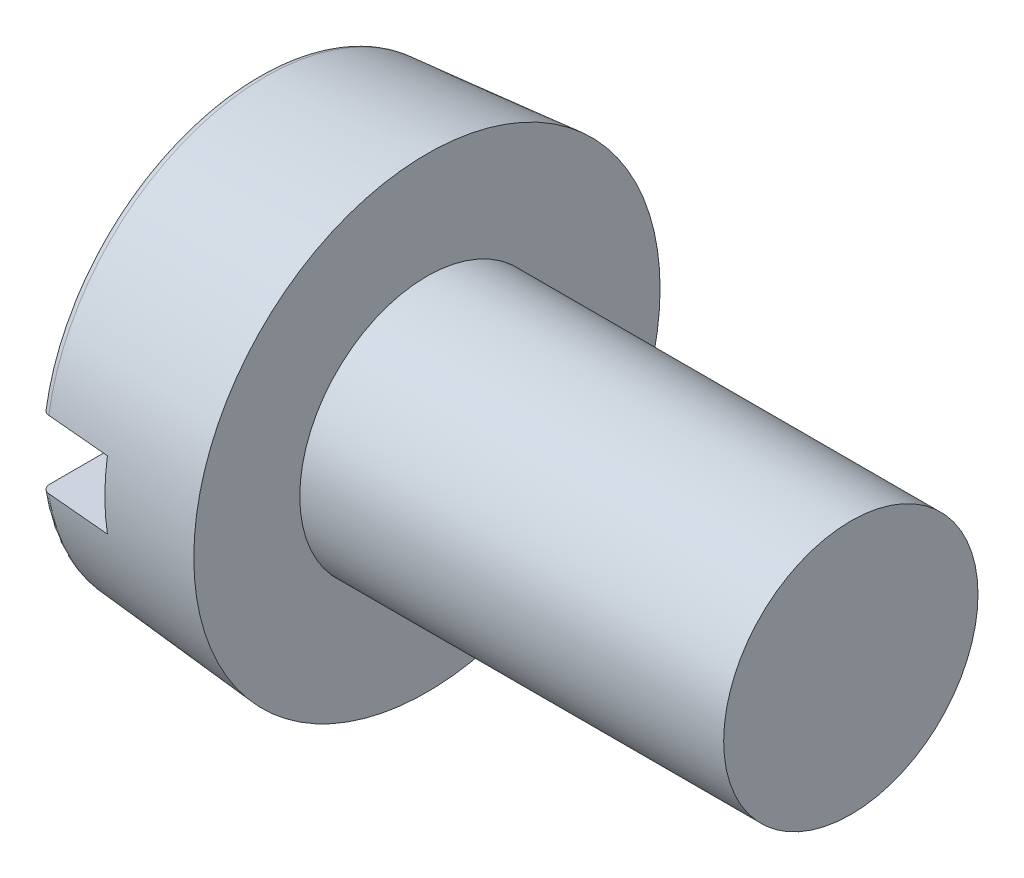
ISO-10303-21;
HEADER;
FILE_DESCRIPTION(('STEP AP214'),'2;1');
FILE_NAME('part.step','',(''),(''),'','','');
FILE_SCHEMA(('AUTOMOTIVE_DESIGN { 1 0 10303 214 1 1 1 1 }'));
ENDSEC;
DATA;
#1=APPLICATION_CONTEXT('core data for automotive mechanical design processes');
#2=APPLICATION_PROTOCOL_DEFINITION('international standard','automotive_design',2000,#1);
#3=PRODUCT_CONTEXT('',#1,'mechanical');
#4=PRODUCT('Part','Part','',(#3));
#5=PRODUCT_RELATED_PRODUCT_CATEGORY('part','',(#4));
#6=PRODUCT_DEFINITION_FORMATION('','',#4);
#7=PRODUCT_DEFINITION_CONTEXT('part definition',#1,'design');
#8=PRODUCT_DEFINITION('design','',#6,#7);
#9=PRODUCT_DEFINITION_SHAPE('','',#8);
#10=(LENGTH_UNIT() NAMED_UNIT(*) SI_UNIT(.MILLI.,.METRE.));
#11=(NAMED_UNIT(*) PLANE_ANGLE_UNIT() SI_UNIT($,.RADIAN.));
#12=(NAMED_UNIT(*) SI_UNIT($,.STERADIAN.) SOLID_ANGLE_UNIT());
#13=UNCERTAINTY_MEASURE_WITH_UNIT(LENGTH_MEASURE(1.E-05),#10,'distance_accuracy_value','');
#14=(GEOMETRIC_REPRESENTATION_CONTEXT(3) GLOBAL_UNCERTAINTY_ASSIGNED_CONTEXT((#13)) GLOBAL_UNIT_ASSIGNED_CONTEXT((#10,
#11,#12)) REPRESENTATION_CONTEXT('',''));
#15=CARTESIAN_POINT('',(0.,0.,0.));
#16=DIRECTION('',(0.,0.,1.));
#17=DIRECTION('',(1.,0.,0.));
#18=AXIS2_PLACEMENT_3D('',#15,#16,#17);
#19=CARTESIAN_POINT('',(0.,0.,0.));
#20=DIRECTION('',(-1.,0.,0.));
#21=DIRECTION('',(0.,0.,1.));
#22=AXIS2_PLACEMENT_3D('',#19,#20,#21);
#23=PLANE('',#22);
#24=DIRECTION('',(0.,0.,-1.));
#25=VECTOR('',#24,1.);
#26=CARTESIAN_POINT('',(0.,0.4,2.75));
#27=LINE('',#26,#25);
#28=CARTESIAN_POINT('',(0.,0.4,2.45096382768024));
#29=VERTEX_POINT('',#28);
#30=CARTESIAN_POINT('',(0.,0.4,-2.45096382768024));
#31=VERTEX_POINT('',#30);
#32=EDGE_CURVE('E99',#29,#31,#27,.T.);
#33=ORIENTED_EDGE('',*,*,#32,.F.);
#34=CARTESIAN_POINT('',(0.,0.,0.));
#35=DIRECTION('',(-1.,0.,0.));
#36=DIRECTION('',(0.,0.,1.));
#37=AXIS2_PLACEMENT_3D('',#34,#35,#36);
#38=CIRCLE('',#37,2.48338955554641);
#39=EDGE_CURVE('E101',#29,#31,#38,.T.);
#40=ORIENTED_EDGE('',*,*,#39,.T.);
#41=EDGE_LOOP('',(#33,#40));
#42=FACE_BOUND('',#41,.T.);
#43=ADVANCED_FACE('F30',(#42),#23,.T.);
#44=CARTESIAN_POINT('',(0.1,0.,0.));
#45=DIRECTION('',(-1.,0.,0.));
#46=DIRECTION('',(0.,0.,1.));
#47=AXIS2_PLACEMENT_3D('',#44,#45,#46);
#48=TOROIDAL_SURFACE('',#47,2.48338955554641,0.1);
#49=CARTESIAN_POINT('',(0.048575166156891,0.4,-2.53782400375256));
#50=CARTESIAN_POINT('',(0.0533355606484265,0.4,-2.54071333010714));
#51=CARTESIAN_POINT('',(0.0583417569081191,0.4,-2.5432050070476));
#52=CARTESIAN_POINT('',(0.0687050566270678,0.4,-2.54731542775851));
#53=CARTESIAN_POINT('',(0.0740625331074315,0.4,-2.5489332261633));
#54=CARTESIAN_POINT('',(0.0849727450829074,0.4,-2.55124400653277));
#55=CARTESIAN_POINT('',(0.0905254381371243,0.4,-2.55193718825242));
#56=CARTESIAN_POINT('',(0.101666850403571,0.4,-2.55237774737396));
#57=CARTESIAN_POINT('',(0.107255560960915,0.4,-2.55212534411489));
#58=CARTESIAN_POINT('',(0.11829297747771,0.4,-2.55068537304434));
#59=CARTESIAN_POINT('',(0.12374207216062,0.4,-2.54950078182478));
#60=CARTESIAN_POINT('',(0.134364973548135,0.4,-2.54623584290949));
#61=CARTESIAN_POINT('',(0.139538770226995,0.4,-2.54415546261615));
#62=CARTESIAN_POINT('',(0.149479719032406,0.4,-2.53915450094368));
#63=CARTESIAN_POINT('',(0.154245774280698,0.4,-2.5362317402539));
#64=CARTESIAN_POINT('',(0.163225267082159,0.4,-2.52963434266423));
#65=CARTESIAN_POINT('',(0.167438683516508,0.4,-2.52595967704439));
#66=CARTESIAN_POINT('',(0.175235238754911,0.4,-2.51792797325945));
#67=CARTESIAN_POINT('',(0.178812290222121,0.4,-2.51356502728085));
#68=CARTESIAN_POINT('',(0.185193520606352,0.4,-2.50430657366979));
#69=CARTESIAN_POINT('',(0.187997652806075,0.4,-2.49941103387087));
#70=CARTESIAN_POINT('',(0.192789155673773,0.4,-2.48916309698215));
#71=CARTESIAN_POINT('',(0.194766254858682,0.4,-2.48380589705));
#72=CARTESIAN_POINT('',(0.197803265284972,0.4,-2.47283752208988));
#73=CARTESIAN_POINT('',(0.198863119308795,0.4,-2.46722633124097));
#74=CARTESIAN_POINT('',(0.200044847417698,0.4,-2.45584788057293));
#75=CARTESIAN_POINT('',(0.200157020578001,0.4,-2.45007961163345));
#76=CARTESIAN_POINT('',(0.199415505351017,0.4,-2.43860536306505));
#77=CARTESIAN_POINT('',(0.198561783586786,0.4,-2.43289938559553));
#78=CARTESIAN_POINT('',(0.195905910130036,0.4,-2.42168897882671));
#79=CARTESIAN_POINT('',(0.19410009575039,0.4,-2.41618541629421));
#80=CARTESIAN_POINT('',(0.189585917001447,0.4,-2.40556157634262));
#81=CARTESIAN_POINT('',(0.186877563222537,0.4,-2.40044129442699));
#82=CARTESIAN_POINT('',(0.180646274399764,0.4,-2.39075689405528));
#83=CARTESIAN_POINT('',(0.177127233156936,0.4,-2.38619027144736));
#84=CARTESIAN_POINT('',(0.169364105535691,0.4,-2.37772142685885));
#85=CARTESIAN_POINT('',(0.165120062398033,0.4,-2.37381916528196));
#86=CARTESIAN_POINT('',(0.156079956749281,0.4,-2.36683969538108));
#87=CARTESIAN_POINT('',(0.151290949374608,0.4,-2.36375335061032));
#88=CARTESIAN_POINT('',(0.141257231753732,0.4,-2.35844131597663));
#89=CARTESIAN_POINT('',(0.136012558112743,0.4,-2.35621555705808));
#90=CARTESIAN_POINT('',(0.125292467405883,0.4,-2.35271848818592));
#91=CARTESIAN_POINT('',(0.119821114682517,0.4,-2.35143471451816));
#92=CARTESIAN_POINT('',(0.108740070260531,0.4,-2.3498129641862));
#93=CARTESIAN_POINT('',(0.103130386873387,0.4,-2.34947493083703));
#94=CARTESIAN_POINT('',(0.0919839198921386,0.4,-2.34975394655982));
#95=CARTESIAN_POINT('',(0.0864469267457431,0.4,-2.3503627089689));
#96=CARTESIAN_POINT('',(0.0755538584306503,0.4,-2.35250103603832));
#97=CARTESIAN_POINT('',(0.070197781285212,0.4,-2.35403059063437));
#98=CARTESIAN_POINT('',(0.0598152881139403,0.4,-2.35796437216879));
#99=CARTESIAN_POINT('',(0.0547889842764087,0.4,-2.36036889496733));
#100=CARTESIAN_POINT('',(0.045206465542065,0.4,-2.36598034847398));
#101=CARTESIAN_POINT('',(0.0406502682628032,0.4,-2.36918730923854));
#102=CARTESIAN_POINT('',(0.0320917632238241,0.4,-2.37634229232291));
#103=CARTESIAN_POINT('',(0.028094870668273,0.4,-2.38029679006583));
#104=CARTESIAN_POINT('',(0.0208109892284717,0.4,-2.3888128469718));
#105=CARTESIAN_POINT('',(0.0175240500802512,0.4,-2.39337444862957));
#106=CARTESIAN_POINT('',(0.0117067345908037,0.4,-2.4030406846898));
#107=CARTESIAN_POINT('',(0.00918709442735102,0.4,-2.40815178065126));
#108=CARTESIAN_POINT('',(0.00503040363865644,0.4,-2.41872109198935));
#109=CARTESIAN_POINT('',(0.00339341411876215,0.4,-2.42417933136926));
#110=CARTESIAN_POINT('',(0.00103079629344816,0.4,-2.4353556964236));
#111=CARTESIAN_POINT('',(0.000315915351137675,0.4,-2.44107609603135));
#112=CARTESIAN_POINT('',(-0.000148268658822413,0.4,-2.45255584173235));
#113=CARTESIAN_POINT('',(0.000102427694162753,0.4,-2.45831518780223));
#114=CARTESIAN_POINT('',(0.00156672863514003,0.4,-2.46973701475673));
#115=CARTESIAN_POINT('',(0.0027847125800623,0.4,-2.47539893515676));
#116=CARTESIAN_POINT('',(0.00615802275625704,0.4,-2.48643816300119));
#117=CARTESIAN_POINT('',(0.00831357182420314,0.4,-2.49181540244276));
#118=CARTESIAN_POINT('',(0.0134950186698153,0.4,-2.50210927446436));
#119=CARTESIAN_POINT('',(0.0165179085314691,0.4,-2.50702742235159));
#120=CARTESIAN_POINT('',(0.0233527300396537,0.4,-2.51627478169689));
#121=CARTESIAN_POINT('',(0.0271636671469903,0.4,-2.52060472418424));
#122=CARTESIAN_POINT('',(0.033939019894037,0.4,-2.52708853011278));
#123=CARTESIAN_POINT('',(0.0367007352855006,0.4,-2.52945777664795));
#124=CARTESIAN_POINT('',(0.0424651118142487,0.4,-2.5338824942972));
#125=CARTESIAN_POINT('',(0.0454677714717265,0.4,-2.53593796733816));
#126=CARTESIAN_POINT('',(0.048575166156891,0.4,-2.53782400375256));
#127=B_SPLINE_CURVE_WITH_KNOTS('',3,(#49,#50,#51,#52,#53,#54,#55,#56,#57,#58,#59,#60,#61,#62,
#63,#64,#65,#66,#67,#68,#69,#70,#71,#72,#73,#74,#75,#76,#77,#78,#79,#80,#81,#82,#83,#84,#85,#86,
#87,#88,#89,#90,#91,#92,#93,#94,#95,#96,#97,#98,#99,#100,#101,#102,#103,#104,#105,#106,#107,
#108,#109,#110,#111,#112,#113,#114,#115,#116,#117,#118,#119,#120,#121,#122,#123,#124,#125,#126),
.UNSPECIFIED.,.T.,.F.,(4,2,2,2,2,2,2,2,2,2,2,2,2,2,2,2,2,2,2,2,2,2,2,2,2,2,2,2,2,2,2,2,2,2,2,2,
2,2,4),(0.,0.0166927261929598,0.0334034746677628,0.0501106123530615,0.0668138748703245,
0.083464017157052,0.100114765390759,0.116808983272007,0.133503838928812,0.150350686192216,
0.167198551500755,0.184249859151125,0.201302230381806,0.21852894916341,0.235756263240368,
0.253050339384405,0.270344212607132,0.287556692602934,0.304768146365554,0.321777815466104,
0.338786119383576,0.355565109802712,0.372343094515803,0.388975057176048,0.405606838051781,
0.422244248001945,0.438882281223626,0.455671655511419,0.472462205603378,0.489477908753089,
0.506494789738005,0.523708265225893,0.54092173038536,0.558213576203892,0.575509534125873,
0.592746220451118,0.609961284890883,0.620857694274183,0.631754036740157),.UNSPECIFIED.);
#128=CARTESIAN_POINT('',(0.0912844257247913,0.4,-2.55184945188353));
#129=VERTEX_POINT('',#128);
#130=EDGE_CURVE('E54',#31,#129,#127,.T.);
#131=ORIENTED_EDGE('',*,*,#130,.F.);
#132=ORIENTED_EDGE('',*,*,#39,.F.);
#133=CARTESIAN_POINT('',(0.0660871367924748,0.4,2.35559521523855));
#134=CARTESIAN_POINT('',(0.0712950927848405,0.4,2.35369117822232));
#135=CARTESIAN_POINT('',(0.0766668570413199,0.4,2.35222401932616));
#136=CARTESIAN_POINT('',(0.0875846729626099,0.4,2.35021144655486));
#137=CARTESIAN_POINT('',(0.0931309090012396,0.4,2.34966704357885));
#138=CARTESIAN_POINT('',(0.10423434578276,0.4,2.34951890222007));
#139=CARTESIAN_POINT('',(0.109791541651094,0.4,2.34991481223107));
#140=CARTESIAN_POINT('',(0.120758977338572,0.4,2.35163438903106));
#141=CARTESIAN_POINT('',(0.126169249425604,0.4,2.3529578503682));
#142=CARTESIAN_POINT('',(0.136691070159668,0.4,2.35649136337689));
#143=CARTESIAN_POINT('',(0.141802658139017,0.4,2.35870129801009));
#144=CARTESIAN_POINT('',(0.151586618009317,0.4,2.36394124838263));
#145=CARTESIAN_POINT('',(0.156258960997779,0.4,2.36697131803635));
#146=CARTESIAN_POINT('',(0.165074157354302,0.4,2.37379047063628));
#147=CARTESIAN_POINT('',(0.169212326798594,0.4,2.37758560642957));
#148=CARTESIAN_POINT('',(0.176803016968956,0.4,2.38580863243915));
#149=CARTESIAN_POINT('',(0.180255493017442,0.4,2.39023656385406));
#150=CARTESIAN_POINT('',(0.186425395678718,0.4,2.39966205876259));
#151=CARTESIAN_POINT('',(0.189132494897015,0.4,2.40466638257535));
#152=CARTESIAN_POINT('',(0.19367967078828,0.4,2.41505452836032));
#153=CARTESIAN_POINT('',(0.195519689004032,0.4,2.42043837589129));
#154=CARTESIAN_POINT('',(0.19830186658775,0.4,2.43150243878165));
#155=CARTESIAN_POINT('',(0.199232942923701,0.4,2.43718544303412));
#156=CARTESIAN_POINT('',(0.200133721631402,0.4,2.44862724862863));
#157=CARTESIAN_POINT('',(0.200103382520145,0.4,2.45438605323057));
#158=CARTESIAN_POINT('',(0.199078617330099,0.4,2.46584997721002));
#159=CARTESIAN_POINT('',(0.198078795088567,0.4,2.47155461557154));
#160=CARTESIAN_POINT('',(0.195132850395625,0.4,2.48271426222291));
#161=CARTESIAN_POINT('',(0.193186731461064,0.4,2.4881692714404));
#162=CARTESIAN_POINT('',(0.188406932533008,0.4,2.49865615099338));
#163=CARTESIAN_POINT('',(0.185575905837541,0.4,2.50368922996592));
#164=CARTESIAN_POINT('',(0.179101091115397,0.4,2.51320240525564));
#165=CARTESIAN_POINT('',(0.175457341207139,0.4,2.51768252749234));
#166=CARTESIAN_POINT('',(0.167497937800454,0.4,2.52591455321073));
#167=CARTESIAN_POINT('',(0.163189244193141,0.4,2.52967318474522));
#168=CARTESIAN_POINT('',(0.153995338004761,0.4,2.53640297535422));
#169=CARTESIAN_POINT('',(0.149110165043673,0.4,2.53937418850051));
#170=CARTESIAN_POINT('',(0.138966186483439,0.4,2.54440671179074));
#171=CARTESIAN_POINT('',(0.133712676926899,0.4,2.54647869854792));
#172=CARTESIAN_POINT('',(0.122930387636139,0.4,2.54970170625043));
#173=CARTESIAN_POINT('',(0.11740162440989,0.4,2.55085278235563));
#174=CARTESIAN_POINT('',(0.106281963774288,0.4,2.55219206612031));
#175=CARTESIAN_POINT('',(0.100692150468509,0.4,2.55238928817214));
#176=CARTESIAN_POINT('',(0.0895592860464744,0.4,2.55183933800322));
#177=CARTESIAN_POINT('',(0.084016233633274,0.4,2.55109219206242));
#178=CARTESIAN_POINT('',(0.0731512358601834,0.4,2.5486799701557));
#179=CARTESIAN_POINT('',(0.0678286781135668,0.4,2.54701764956405));
#180=CARTESIAN_POINT('',(0.0575363587723272,0.4,2.54282694850188));
#181=CARTESIAN_POINT('',(0.0525666019474389,0.4,2.54029855632511));
#182=CARTESIAN_POINT('',(0.0430955298033929,0.4,2.53443716654266));
#183=CARTESIAN_POINT('',(0.0385964469739406,0.4,2.53110056307376));
#184=CARTESIAN_POINT('',(0.0302151234190864,0.4,2.52372648341994));
#185=CARTESIAN_POINT('',(0.0263329113383121,0.4,2.51968897470644));
#186=CARTESIAN_POINT('',(0.0192521281963955,0.4,2.51098384815933));
#187=CARTESIAN_POINT('',(0.0160610119836797,0.4,2.5063101674796));
#188=CARTESIAN_POINT('',(0.0104977647710909,0.4,2.49649850826804));
#189=CARTESIAN_POINT('',(0.008125688056225,0.4,2.49136049898949));
#190=CARTESIAN_POINT('',(0.00423822124527595,0.4,2.48069955197135));
#191=CARTESIAN_POINT('',(0.00273352009700214,0.4,2.4751727157723));
#192=CARTESIAN_POINT('',(0.000664174238576025,0.4,2.4639457200927));
#193=CARTESIAN_POINT('',(9.95845082644301E-05,0.4,2.45824555049506));
#194=CARTESIAN_POINT('',(-7.62295306058083E-05,0.4,2.4467793069312));
#195=CARTESIAN_POINT('',(0.000321125140370782,0.4,2.44101309976124));
#196=CARTESIAN_POINT('',(0.00207635443678246,0.4,2.42962883569642));
#197=CARTESIAN_POINT('',(0.00343421550729679,0.4,2.424010776712));
#198=CARTESIAN_POINT('',(0.00707734815742784,0.4,2.41307368443565));
#199=CARTESIAN_POINT('',(0.00936409323791585,0.4,2.40775514160471));
#200=CARTESIAN_POINT('',(0.0148046906814124,0.4,2.39757966614318));
#201=CARTESIAN_POINT('',(0.0179587364122388,0.4,2.39272283677864));
#202=CARTESIAN_POINT('',(0.0250240732994678,0.4,2.38364579035037));
#203=CARTESIAN_POINT('',(0.028930393182573,0.4,2.37942170099146));
#204=CARTESIAN_POINT('',(0.0374021808573991,0.4,2.3717039963052));
#205=CARTESIAN_POINT('',(0.0419667955357701,0.4,2.36820944966134));
#206=CARTESIAN_POINT('',(0.0498248602432987,0.4,2.36320077013841));
#207=CARTESIAN_POINT('',(0.0529598990957758,0.4,2.36143340044221));
#208=CARTESIAN_POINT('',(0.0594027181877436,0.4,2.35824787663633));
#209=CARTESIAN_POINT('',(0.0627104972052009,0.4,2.35682972005658));
#210=CARTESIAN_POINT('',(0.0660871367924748,0.4,2.35559521523855));
#211=B_SPLINE_CURVE_WITH_KNOTS('',3,(#133,#134,#135,#136,#137,#138,#139,#140,#141,#142,#143,
#144,#145,#146,#147,#148,#149,#150,#151,#152,#153,#154,#155,#156,#157,#158,#159,#160,#161,#162,
#163,#164,#165,#166,#167,#168,#169,#170,#171,#172,#173,#174,#175,#176,#177,#178,#179,#180,#181,
#182,#183,#184,#185,#186,#187,#188,#189,#190,#191,#192,#193,#194,#195,#196,#197,#198,#199,#200,
#201,#202,#203,#204,#205,#206,#207,#208,#209,#210),.UNSPECIFIED.,.T.,.F.,(4,2,2,2,2,2,2,2,2,2,2,
2,2,2,2,2,2,2,2,2,2,2,2,2,2,2,2,2,2,2,2,2,2,2,2,2,2,2,4),(0.,0.0166222541478178,
0.0332627065942931,0.0498969377446,0.0665274855903882,0.0831558384784716,0.0997852847538597,
0.116551858795267,0.133319524934732,0.150308994702433,0.16729960970923,0.184494901354412,
0.201690934940426,0.218983234681924,0.236275470158237,0.253516346249615,0.270756413877769,
0.287826942378046,0.304896298346318,0.321757040586668,0.338616772841758,0.355316856730834,
0.372016475898999,0.388666089268514,0.405315927691638,0.422041464353441,0.438767777445074,
0.455666404024134,0.472566150410065,0.489669935249993,0.506774720322792,0.524032613353523,
0.541290262841154,0.558575395944134,0.575864385959096,0.593042819367108,0.610199187265657,
0.620976497689188,0.631753731880016),.UNSPECIFIED.);
#212=CARTESIAN_POINT('',(0.0912844257242422,0.4,2.55184945188577));
#213=VERTEX_POINT('',#212);
#214=EDGE_CURVE('E91',#213,#29,#211,.T.);
#215=ORIENTED_EDGE('',*,*,#214,.F.);
#216=CARTESIAN_POINT('',(0.0912844257252299,0.,0.));
#217=DIRECTION('',(-1.,0.,0.));
#218=DIRECTION('',(0.,0.,1.));
#219=AXIS2_PLACEMENT_3D('',#216,#217,#218);
#220=CIRCLE('',#219,2.58300902535558);
#221=EDGE_CURVE('E105',#129,#213,#220,.F.);
#222=ORIENTED_EDGE('',*,*,#221,.F.);
#223=EDGE_LOOP('',(#131,#132,#215,#222));
#224=FACE_BOUND('',#223,.T.);
#225=ADVANCED_FACE('F176',(#224),#48,.T.);
#226=CARTESIAN_POINT('',(-25.4,0.,0.));
#227=DIRECTION('',(-1.,0.,0.));
#228=DIRECTION('',(0.,0.,1.));
#229=AXIS2_PLACEMENT_3D('',#226,#227,#228);
#230=CYLINDRICAL_SURFACE('',#229,1.5);
#231=CARTESIAN_POINT('',(7.,0.,0.));
#232=DIRECTION('',(-1.,0.,0.));
#233=DIRECTION('',(0.,0.,1.));
#234=AXIS2_PLACEMENT_3D('',#231,#232,#233);
#235=CIRCLE('',#234,1.5);
#236=CARTESIAN_POINT('',(7.,0.,1.5));
#237=VERTEX_POINT('',#236);
#238=EDGE_CURVE('E102',#237,#237,#235,.T.);
#239=ORIENTED_EDGE('',*,*,#238,.T.);
#240=EDGE_LOOP('',(#239));
#241=FACE_BOUND('',#240,.T.);
#242=CARTESIAN_POINT('',(2.,0.,0.));
#243=DIRECTION('',(-1.,0.,0.));
#244=DIRECTION('',(0.,0.,1.));
#245=AXIS2_PLACEMENT_3D('',#242,#243,#244);
#246=CIRCLE('',#245,1.5);
#247=CARTESIAN_POINT('',(2.,0.,1.5));
#248=VERTEX_POINT('',#247);
#249=EDGE_CURVE('E163',#248,#248,#246,.T.);
#250=ORIENTED_EDGE('',*,*,#249,.F.);
#251=EDGE_LOOP('',(#250));
#252=FACE_BOUND('',#251,.T.);
#253=ADVANCED_FACE('F173',(#241,#252),#230,.T.);
#254=CARTESIAN_POINT('',(7.,1.5,0.));
#255=DIRECTION('',(1.,0.,0.));
#256=DIRECTION('',(0.,0.,-1.));
#257=AXIS2_PLACEMENT_3D('',#254,#255,#256);
#258=PLANE('',#257);
#259=ORIENTED_EDGE('',*,*,#238,.F.);
#260=EDGE_LOOP('',(#259));
#261=FACE_BOUND('',#260,.T.);
#262=ADVANCED_FACE('F175',(#261),#258,.T.);
#263=DIRECTION('',(0.,0.,1.));
#264=VECTOR('',#263,1.);
#265=CARTESIAN_POINT('',(0.,-0.4,-2.75));
#266=LINE('',#265,#264);
#267=CARTESIAN_POINT('',(0.,-0.4,-2.45096382768024));
#268=VERTEX_POINT('',#267);
#269=CARTESIAN_POINT('',(0.,-0.4,2.45096382768024));
#270=VERTEX_POINT('',#269);
#271=EDGE_CURVE('E46',#268,#270,#266,.T.);
#272=ORIENTED_EDGE('',*,*,#271,.F.);
#273=EDGE_CURVE('E97',#268,#270,#38,.T.);
#274=ORIENTED_EDGE('',*,*,#273,.T.);
#275=EDGE_LOOP('',(#272,#274));
#276=FACE_BOUND('',#275,.T.);
#277=ADVANCED_FACE('F96',(#276),#23,.T.);
#278=CARTESIAN_POINT('',(0.,0.,0.));
#279=DIRECTION('',(1.,0.,0.));
#280=DIRECTION('',(0.,0.,-1.));
#281=AXIS2_PLACEMENT_3D('',#278,#279,#280);
#282=CONICAL_SURFACE('',#281,2.57502267294815,0.0872664625997166);
#283=CARTESIAN_POINT('',(-4.36225986914578,0.4,-2.15659249784001));
#284=CARTESIAN_POINT('',(-3.0225287932993,0.4,-2.27578971400985));
#285=CARTESIAN_POINT('',(-1.68277158070832,0.4,-2.3946924855258));
#286=CARTESIAN_POINT('',(-0.087192971572956,0.4,-2.53604555798389));
#287=CARTESIAN_POINT('',(0.168610376643266,0.4,-2.55869953286896));
#288=CARTESIAN_POINT('',(2.02000114161502,0.4,-2.72260692865391));
#289=CARTESIAN_POINT('',(3.61561248830953,0.4,-2.86359016848939));
#290=CARTESIAN_POINT('',(5.21123588736543,0.4,-3.00443640584799));
#291=B_SPLINE_CURVE_WITH_KNOTS('',3,(#283,#284,#285,#286,#287,#288,#289,#290),.UNSPECIFIED.,.F.,
.F.,(4,2,2,4),(0.,4.03506939923899,4.80548292410975,9.61096578658458),.UNSPECIFIED.);
#292=CARTESIAN_POINT('',(0.85,0.4,-2.61901832187334));
#293=VERTEX_POINT('',#292);
#294=EDGE_CURVE('E158',#129,#293,#291,.T.);
#295=ORIENTED_EDGE('',*,*,#294,.F.);
#296=ORIENTED_EDGE('',*,*,#221,.T.);
#297=CARTESIAN_POINT('',(5.21123588736543,0.4,3.00443640584799));
#298=CARTESIAN_POINT('',(4.41342358696222,0.4,2.93401988873196));
#299=CARTESIAN_POINT('',(3.61561486907633,0.4,2.86356274948076));
#300=CARTESIAN_POINT('',(2.02000692465129,0.4,2.72254136292326));
#301=CARTESIAN_POINT('',(1.22220769811185,0.4,2.65197711562021));
#302=CARTESIAN_POINT('',(-0.373378996688642,0.4,2.51071564393346));
#303=CARTESIAN_POINT('',(-1.17116646494953,0.4,2.44001841954794));
#304=CARTESIAN_POINT('',(-2.76672581923324,0.4,2.298448092182));
#305=CARTESIAN_POINT('',(-3.56449770525558,0.4,2.22757498919617));
#306=CARTESIAN_POINT('',(-4.36225986914578,0.4,2.15659249784001));
#307=B_SPLINE_CURVE_WITH_KNOTS('',3,(#297,#298,#299,#300,#301,#302,#303,#304,#305,#306),
.UNSPECIFIED.,.F.,.F.,(4,2,2,2,4),(0.,2.40274147318214,4.80548287330204,7.20822430613117,
9.6109658126378),.UNSPECIFIED.);
#308=CARTESIAN_POINT('',(0.85,0.4,2.61901832187334));
#309=VERTEX_POINT('',#308);
#310=EDGE_CURVE('E154',#309,#213,#307,.T.);
#311=ORIENTED_EDGE('',*,*,#310,.F.);
#312=CARTESIAN_POINT('',(0.85,0.,0.));
#313=DIRECTION('',(-1.,0.,0.));
#314=DIRECTION('',(0.,0.,1.));
#315=AXIS2_PLACEMENT_3D('',#312,#313,#314);
#316=CIRCLE('',#315,2.64938803694519);
#317=CARTESIAN_POINT('',(0.85,-0.4,2.61901832187334));
#318=VERTEX_POINT('',#317);
#319=EDGE_CURVE('E35',#309,#318,#316,.F.);
#320=ORIENTED_EDGE('',*,*,#319,.T.);
#321=CARTESIAN_POINT('',(-4.36225986914578,-0.4,2.15659249784001));
#322=CARTESIAN_POINT('',(-3.0225287932993,-0.4,2.27578971400985));
#323=CARTESIAN_POINT('',(-1.68277158070832,-0.4,2.3946924855258));
#324=CARTESIAN_POINT('',(-0.087192971572956,-0.4,2.53604555798389));
#325=CARTESIAN_POINT('',(0.168610376643266,-0.4,2.55869953286896));
#326=CARTESIAN_POINT('',(2.02000114161502,-0.4,2.72260692865391));
#327=CARTESIAN_POINT('',(3.61561248830953,-0.400000000000001,2.86359016848939));
#328=CARTESIAN_POINT('',(5.21123588736543,-0.4,3.00443640584799));
#329=B_SPLINE_CURVE_WITH_KNOTS('',3,(#321,#322,#323,#324,#325,#326,#327,#328),.UNSPECIFIED.,.F.,
.F.,(4,2,2,4),(0.,4.03506939923899,4.80548292410975,9.61096578658458),.UNSPECIFIED.);
#330=CARTESIAN_POINT('',(0.0912844257252299,-0.4,2.5518494518816));
#331=VERTEX_POINT('',#330);
#332=EDGE_CURVE('E132',#331,#318,#329,.T.);
#333=ORIENTED_EDGE('',*,*,#332,.F.);
#334=CARTESIAN_POINT('',(0.0912844257252299,-0.4,-2.55184945188164));
#335=VERTEX_POINT('',#334);
#336=EDGE_CURVE('E111',#331,#335,#220,.F.);
#337=ORIENTED_EDGE('',*,*,#336,.T.);
#338=CARTESIAN_POINT('',(5.21123588736543,-0.4,-3.00443640584799));
#339=CARTESIAN_POINT('',(4.41342358696222,-0.4,-2.93401988873196));
#340=CARTESIAN_POINT('',(3.61561486907633,-0.4,-2.86356274948076));
#341=CARTESIAN_POINT('',(2.02000692465129,-0.4,-2.72254136292326));
#342=CARTESIAN_POINT('',(1.22220769811185,-0.4,-2.65197711562021));
#343=CARTESIAN_POINT('',(-0.373378996688642,-0.4,-2.51071564393346));
#344=CARTESIAN_POINT('',(-1.17116646494953,-0.4,-2.44001841954794));
#345=CARTESIAN_POINT('',(-2.76672581923324,-0.4,-2.298448092182));
#346=CARTESIAN_POINT('',(-3.56449770525558,-0.4,-2.22757498919617));
#347=CARTESIAN_POINT('',(-4.36225986914578,-0.4,-2.15659249784001));
#348=B_SPLINE_CURVE_WITH_KNOTS('',3,(#338,#339,#340,#341,#342,#343,#344,#345,#346,#347),
.UNSPECIFIED.,.F.,.F.,(4,2,2,2,4),(0.,2.40274147318214,4.80548287330204,7.20822430613117,
9.6109658126378),.UNSPECIFIED.);
#349=CARTESIAN_POINT('',(0.85,-0.4,-2.61901832187334));
#350=VERTEX_POINT('',#349);
#351=EDGE_CURVE('E86',#350,#335,#348,.T.);
#352=ORIENTED_EDGE('',*,*,#351,.F.);
#353=EDGE_CURVE('E11',#350,#293,#316,.F.);
#354=ORIENTED_EDGE('',*,*,#353,.T.);
#355=EDGE_LOOP('',(#295,#296,#311,#320,#333,#337,#352,#354));
#356=FACE_BOUND('',#355,.T.);
#357=CARTESIAN_POINT('',(2.,0.,0.));
#358=DIRECTION('',(-1.,0.,0.));
#359=DIRECTION('',(0.,0.,1.));
#360=AXIS2_PLACEMENT_3D('',#357,#358,#359);
#361=CIRCLE('',#360,2.75);
#362=CARTESIAN_POINT('',(2.,0.,2.75));
#363=VERTEX_POINT('',#362);
#364=EDGE_CURVE('E107',#363,#363,#361,.T.);
#365=ORIENTED_EDGE('',*,*,#364,.T.);
#366=EDGE_LOOP('',(#365));
#367=FACE_BOUND('',#366,.T.);
#368=ADVANCED_FACE('F143',(#356,#367),#282,.T.);
#369=CARTESIAN_POINT('',(2.,1.5,0.));
#370=DIRECTION('',(-1.,0.,0.));
#371=DIRECTION('',(0.,0.,1.));
#372=AXIS2_PLACEMENT_3D('',#369,#370,#371);
#373=PLANE('',#372);
#374=ORIENTED_EDGE('',*,*,#364,.F.);
#375=EDGE_LOOP('',(#374));
#376=FACE_BOUND('',#375,.T.);
#377=ORIENTED_EDGE('',*,*,#249,.T.);
#378=EDGE_LOOP('',(#377));
#379=FACE_BOUND('',#378,.T.);
#380=ADVANCED_FACE('F147',(#376,#379),#373,.F.);
#381=CARTESIAN_POINT('',(0.048575166156891,-0.4,-2.53782400375256));
#382=CARTESIAN_POINT('',(0.0437427008890714,-0.4,-2.53489033603248));
#383=CARTESIAN_POINT('',(0.0391565039520041,-0.4,-2.53154249233901));
#384=CARTESIAN_POINT('',(0.0306096912349627,-0.4,-2.52411912703245));
#385=CARTESIAN_POINT('',(0.0266499199134268,-0.4,-2.52004263865816));
#386=CARTESIAN_POINT('',(0.0194724144414626,-0.4,-2.51128827187888));
#387=CARTESIAN_POINT('',(0.0162539430758676,-0.4,-2.5066109982245));
#388=CARTESIAN_POINT('',(0.0106407914468121,-0.4,-2.49678789814068));
#389=CARTESIAN_POINT('',(0.00824590952942863,-0.4,-2.49164218679789));
#390=CARTESIAN_POINT('',(0.0043228424573728,-0.4,-2.48097764448566));
#391=CARTESIAN_POINT('',(0.00280265847762351,-0.4,-2.47545587010949));
#392=CARTESIAN_POINT('',(0.000701595208248024,-0.4,-2.46423612609241));
#393=CARTESIAN_POINT('',(0.000120808101595798,-0.4,-2.45853813921568));
#394=CARTESIAN_POINT('',(-8.77639340342429E-05,-0.4,-2.44707338759541));
#395=CARTESIAN_POINT('',(0.000293055254025309,-0.4,-2.44130646469098));
#396=CARTESIAN_POINT('',(0.00201549855238182,-0.4,-2.42991778305268));
#397=CARTESIAN_POINT('',(0.00335714465243903,-0.4,-2.42429602764421));
#398=CARTESIAN_POINT('',(0.00696895281533353,-0.4,-2.41334782418293));
#399=CARTESIAN_POINT('',(0.00924075615667539,-0.4,-2.40802191712191));
#400=CARTESIAN_POINT('',(0.0146521431767627,-0.4,-2.39783066596844));
#401=CARTESIAN_POINT('',(0.0177917032773436,-0.4,-2.39296530936701));
#402=CARTESIAN_POINT('',(0.0248287411053439,-0.4,-2.38387042526437));
#403=CARTESIAN_POINT('',(0.0287209141925633,-0.4,-2.37963679509589));
#404=CARTESIAN_POINT('',(0.0371689847043478,-0.4,-2.37189344325919));
#405=CARTESIAN_POINT('',(0.0417248374973387,-0.4,-2.36838367295066));
#406=CARTESIAN_POINT('',(0.0513088940529654,-0.4,-2.36223607999804));
#407=CARTESIAN_POINT('',(0.0563303170031127,-0.4,-2.35958768701902));
#408=CARTESIAN_POINT('',(0.0667506637390637,-0.4,-2.35518417776549));
#409=CARTESIAN_POINT('',(0.0721495575296726,-0.4,-2.35342899060518));
#410=CARTESIAN_POINT('',(0.0830969218562004,-0.4,-2.35088371920364));
#411=CARTESIAN_POINT('',(0.0886425771214819,-0.4,-2.35008151768943));
#412=CARTESIAN_POINT('',(0.0997895698319834,-0.4,-2.34942645825663));
#413=CARTESIAN_POINT('',(0.105390904537028,-0.4,-2.34957355384856));
#414=CARTESIAN_POINT('',(0.116450989483532,-0.4,-2.35080823875911));
#415=CARTESIAN_POINT('',(0.121910439899226,-0.4,-2.35188957154329));
#416=CARTESIAN_POINT('',(0.132571054932582,-0.4,-2.35495102017176));
#417=CARTESIAN_POINT('',(0.137772218979377,-0.4,-2.35693113800247));
#418=CARTESIAN_POINT('',(0.147785607499864,-0.4,-2.36173694974296));
#419=CARTESIAN_POINT('',(0.152596707655126,-0.4,-2.36456498478211));
#420=CARTESIAN_POINT('',(0.161682450459403,-0.4,-2.37098051347151));
#421=CARTESIAN_POINT('',(0.165957067006596,-0.4,-2.3745680440511));
#422=CARTESIAN_POINT('',(0.173898476720827,-0.4,-2.38244089229649));
#423=CARTESIAN_POINT('',(0.177558250715634,-0.4,-2.38673328868116));
#424=CARTESIAN_POINT('',(0.184116745306165,-0.4,-2.39586460061934));
#425=CARTESIAN_POINT('',(0.187015411909099,-0.4,-2.40070355491074));
#426=CARTESIAN_POINT('',(0.1920102965789,-0.4,-2.41086084949244));
#427=CARTESIAN_POINT('',(0.194095133740737,-0.4,-2.41618478733958));
#428=CARTESIAN_POINT('',(0.197351618314204,-0.4,-2.42710502099882));
#429=CARTESIAN_POINT('',(0.198523208401552,-0.4,-2.43270133388441));
#430=CARTESIAN_POINT('',(0.199929764454566,-0.4,-2.44406834904127));
#431=CARTESIAN_POINT('',(0.200155100074746,-0.4,-2.4498402450028));
#432=CARTESIAN_POINT('',(0.199636288045938,-0.4,-2.4613404318168));
#433=CARTESIAN_POINT('',(0.198892115679426,-0.4,-2.46706872155379));
#434=CARTESIAN_POINT('',(0.196450104345965,-0.4,-2.4783334263322));
#435=CARTESIAN_POINT('',(0.19474990339858,-0.4,-2.48386932995355));
#436=CARTESIAN_POINT('',(0.190438851147455,-0.4,-2.49457461930592));
#437=CARTESIAN_POINT('',(0.187828017040739,-0.4,-2.49974401195618));
#438=CARTESIAN_POINT('',(0.18178416821025,-0.4,-2.50953562475824));
#439=CARTESIAN_POINT('',(0.178356081275476,-0.4,-2.51416088532287));
#440=CARTESIAN_POINT('',(0.170763854311403,-0.4,-2.52276187931021));
#441=CARTESIAN_POINT('',(0.166599755887439,-0.4,-2.52673764942296));
#442=CARTESIAN_POINT('',(0.157703749960622,-0.4,-2.53387831326103));
#443=CARTESIAN_POINT('',(0.152978790793139,-0.4,-2.53705186263633));
#444=CARTESIAN_POINT('',(0.143058302597854,-0.4,-2.54254944807672));
#445=CARTESIAN_POINT('',(0.137862824904435,-0.4,-2.54487357667608));
#446=CARTESIAN_POINT('',(0.127215096181335,-0.4,-2.54857855240269));
#447=CARTESIAN_POINT('',(0.121766627201613,-0.4,-2.54997027378005));
#448=CARTESIAN_POINT('',(0.110711267088447,-0.4,-2.55181190787766));
#449=CARTESIAN_POINT('',(0.105104343718789,-0.4,-2.55226162753717));
#450=CARTESIAN_POINT('',(0.0939347715007496,-0.4,-2.552205294953));
#451=CARTESIAN_POINT('',(0.0883720843451969,-0.4,-2.55170582304087));
#452=CARTESIAN_POINT('',(0.0774146742968055,-0.4,-2.54977933214903));
#453=CARTESIAN_POINT('',(0.0720197510015727,-0.4,-2.54835346819235));
#454=CARTESIAN_POINT('',(0.063613486179649,-0.4,-2.54535751471384));
#455=CARTESIAN_POINT('',(0.0605001894166254,-0.4,-2.54406538475537));
#456=CARTESIAN_POINT('',(0.0544205154682448,-0.4,-2.54117250369181));
#457=CARTESIAN_POINT('',(0.0514541373617029,-0.4,-2.53957175452209));
#458=CARTESIAN_POINT('',(0.048575166156891,-0.4,-2.53782400375256));
#459=B_SPLINE_CURVE_WITH_KNOTS('',3,(#381,#382,#383,#384,#385,#386,#387,#388,#389,#390,#391,
#392,#393,#394,#395,#396,#397,#398,#399,#400,#401,#402,#403,#404,#405,#406,#407,#408,#409,#410,
#411,#412,#413,#414,#415,#416,#417,#418,#419,#420,#421,#422,#423,#424,#425,#426,#427,#428,#429,
#430,#431,#432,#433,#434,#435,#436,#437,#438,#439,#440,#441,#442,#443,#444,#445,#446,#447,#448,
#449,#450,#451,#452,#453,#454,#455,#456,#457,#458),.UNSPECIFIED.,.T.,.F.,(4,2,2,2,2,2,2,2,2,2,2,
2,2,2,2,2,2,2,2,2,2,2,2,2,2,2,2,2,2,2,2,2,2,2,2,2,2,2,4),(0.,0.0169472407322672,
0.0339171361601506,0.0508700816238967,0.0678188732388524,0.0849203328631089,0.102023470551058,
0.119280182389638,0.136537289182897,0.153824978576453,0.171112198285484,0.188281743401668,
0.205450134421422,0.222399111451824,0.239346743182754,0.256076496133358,0.272805429792138,
0.289423191548409,0.306040990031791,0.322705100111853,0.339370020645595,0.356213876748639,
0.373058927428501,0.390131760531073,0.407205665204685,0.424452921752969,0.441700618027207,
0.458991115172603,0.476281285810015,0.493469727421073,0.510657197712654,0.527650439747465,
0.544641830018657,0.561431437560975,0.578224485752214,0.594901539591072,0.611557840324385,
0.621654327588065,0.631750751538408),.UNSPECIFIED.);
#460=EDGE_CURVE('E82',#335,#268,#459,.T.);
#461=ORIENTED_EDGE('',*,*,#460,.F.);
#462=ORIENTED_EDGE('',*,*,#336,.F.);
#463=CARTESIAN_POINT('',(0.0660871367924749,-0.4,2.35559521523855));
#464=CARTESIAN_POINT('',(0.0608105945502038,-0.4,2.35752487852842));
#465=CARTESIAN_POINT('',(0.0556944752428509,-0.4,2.3599059129028));
#466=CARTESIAN_POINT('',(0.0459323966354484,-0.4,2.36549830449194));
#467=CARTESIAN_POINT('',(0.0412870687197798,-0.4,2.36871075675094));
#468=CARTESIAN_POINT('',(0.032604379070265,-0.4,2.37586468923515));
#469=CARTESIAN_POINT('',(0.0285663918791524,-0.4,2.37980541001391));
#470=CARTESIAN_POINT('',(0.0212026684834657,-0.4,2.38830165313251));
#471=CARTESIAN_POINT('',(0.0178767642753712,-0.4,2.39285703004061));
#472=CARTESIAN_POINT('',(0.011993454988691,-0.4,2.4025019984765));
#473=CARTESIAN_POINT('',(0.00944402228749019,-0.4,2.40759645260631));
#474=CARTESIAN_POINT('',(0.0052251979680423,-0.4,2.41813782358851));
#475=CARTESIAN_POINT('',(0.0035559000210214,-0.4,2.42358477788764));
#476=CARTESIAN_POINT('',(0.00112661898390303,-0.4,2.43474435525461));
#477=CARTESIAN_POINT('',(0.000377433998971087,-0.4,2.44045933087073));
#478=CARTESIAN_POINT('',(-0.000155971609909065,-0.4,2.45193424749558));
#479=CARTESIAN_POINT('',(5.9843753921386E-05,-0.4,2.45769419017327));
#480=CARTESIAN_POINT('',(0.00145482264639185,-0.4,2.4691245835607));
#481=CARTESIAN_POINT('',(0.00263861487831216,-0.4,2.47479447055272));
#482=CARTESIAN_POINT('',(0.00594479382623154,-0.4,2.48585382181204));
#483=CARTESIAN_POINT('',(0.00806717094823211,-0.4,2.4912432889451));
#484=CARTESIAN_POINT('',(0.0131842826089137,-0.4,2.50156580381608));
#485=CARTESIAN_POINT('',(0.0161757093406998,-0.4,2.50650049043758));
#486=CARTESIAN_POINT('',(0.0229526816297061,-0.4,2.51579078048696));
#487=CARTESIAN_POINT('',(0.026738188211274,-0.4,2.52014641231933));
#488=CARTESIAN_POINT('',(0.0349549522819587,-0.4,2.52810621279062));
#489=CARTESIAN_POINT('',(0.0393791679507025,-0.4,2.53171764933511));
#490=CARTESIAN_POINT('',(0.0487773745070079,-0.4,2.53813557351638));
#491=CARTESIAN_POINT('',(0.0537513271234723,-0.4,2.54094211713863));
#492=CARTESIAN_POINT('',(0.0640426596902499,-0.4,2.54563498979798));
#493=CARTESIAN_POINT('',(0.0693551226039391,-0.4,2.5475321037118));
#494=CARTESIAN_POINT('',(0.0802247129351561,-0.4,2.55039839200113));
#495=CARTESIAN_POINT('',(0.0857818262597897,-0.4,2.55136761975382));
#496=CARTESIAN_POINT('',(0.0969295068477407,-0.4,2.55234385612009));
#497=CARTESIAN_POINT('',(0.102519326325114,-0.4,2.55235942192522));
#498=CARTESIAN_POINT('',(0.113621717842258,-0.4,2.55144947170831));
#499=CARTESIAN_POINT('',(0.119134291728872,-0.4,2.55052397822485));
#500=CARTESIAN_POINT('',(0.12991315715357,-0.4,2.54776325488686));
#501=CARTESIAN_POINT('',(0.135179979695444,-0.4,2.54593009634288));
#502=CARTESIAN_POINT('',(0.14533338195721,-0.4,2.54141002564133));
#503=CARTESIAN_POINT('',(0.150219955236063,-0.4,2.53872309902571));
#504=CARTESIAN_POINT('',(0.159502666916409,-0.4,2.5325586246071));
#505=CARTESIAN_POINT('',(0.163896113948941,-0.4,2.52907702558496));
#506=CARTESIAN_POINT('',(0.172043834916818,-0.4,2.52143276158102));
#507=CARTESIAN_POINT('',(0.175798076961159,-0.4,2.51727006263833));
#508=CARTESIAN_POINT('',(0.182604163786229,-0.4,2.50833478591539));
#509=CARTESIAN_POINT('',(0.185648086206779,-0.4,2.50355617440357));
#510=CARTESIAN_POINT('',(0.19090152145622,-0.4,2.49356047830666));
#511=CARTESIAN_POINT('',(0.193110979885753,-0.4,2.4883433651624));
#512=CARTESIAN_POINT('',(0.196659930990868,-0.4,2.47755170451601));
#513=CARTESIAN_POINT('',(0.197988676101266,-0.4,2.47197362162933));
#514=CARTESIAN_POINT('',(0.199699497616489,-0.4,2.46067407504842));
#515=CARTESIAN_POINT('',(0.200081523174489,-0.4,2.45495260366968));
#516=CARTESIAN_POINT('',(0.199888693786855,-0.4,2.44347761139863));
#517=CARTESIAN_POINT('',(0.199305786466706,-0.4,2.43772422417512));
#518=CARTESIAN_POINT('',(0.197183396962278,-0.4,2.42639649613519));
#519=CARTESIAN_POINT('',(0.195643893907937,-0.4,2.42082215922791));
#520=CARTESIAN_POINT('',(0.191647358782498,-0.4,2.41000689513081));
#521=CARTESIAN_POINT('',(0.189189525029138,-0.4,2.40476626395098));
#522=CARTESIAN_POINT('',(0.183422446278923,-0.4,2.39477626653133));
#523=CARTESIAN_POINT('',(0.180113225729291,-0.4,2.39002688619092));
#524=CARTESIAN_POINT('',(0.172762307166355,-0.4,2.38119455975028));
#525=CARTESIAN_POINT('',(0.168726370035365,-0.4,2.37710682086271));
#526=CARTESIAN_POINT('',(0.160017645288821,-0.4,2.36967805871209));
#527=CARTESIAN_POINT('',(0.155344928487096,-0.4,2.36633695252778));
#528=CARTESIAN_POINT('',(0.145561135599925,-0.4,2.36054338093363));
#529=CARTESIAN_POINT('',(0.140456663489582,-0.4,2.35807976269219));
#530=CARTESIAN_POINT('',(0.129901516966527,-0.4,2.35405629153212));
#531=CARTESIAN_POINT('',(0.12445078098188,-0.4,2.35249659984984));
#532=CARTESIAN_POINT('',(0.113430211306763,-0.4,2.35034396470641));
#533=CARTESIAN_POINT('',(0.107862588812257,-0.4,2.34973965558371));
#534=CARTESIAN_POINT('',(0.0967101969668423,-0.4,2.34948171969541));
#535=CARTESIAN_POINT('',(0.0911254588247305,-0.4,2.34982687285342));
#536=CARTESIAN_POINT('',(0.0822854426850385,-0.4,2.35112999215385));
#537=CARTESIAN_POINT('',(0.0789835903303941,-0.4,2.35179110990866));
#538=CARTESIAN_POINT('',(0.072464361176773,-0.4,2.35344593540385));
#539=CARTESIAN_POINT('',(0.0692469836329162,-0.4,2.3544396402105));
#540=CARTESIAN_POINT('',(0.0660871367924749,-0.4,2.35559521523855));
#541=B_SPLINE_CURVE_WITH_KNOTS('',3,(#463,#464,#465,#466,#467,#468,#469,#470,#471,#472,#473,
#474,#475,#476,#477,#478,#479,#480,#481,#482,#483,#484,#485,#486,#487,#488,#489,#490,#491,#492,
#493,#494,#495,#496,#497,#498,#499,#500,#501,#502,#503,#504,#505,#506,#507,#508,#509,#510,#511,
#512,#513,#514,#515,#516,#517,#518,#519,#520,#521,#522,#523,#524,#525,#526,#527,#528,#529,#530,
#531,#532,#533,#534,#535,#536,#537,#538,#539,#540),.UNSPECIFIED.,.T.,.F.,(4,2,2,2,2,2,2,2,2,2,2,
2,2,2,2,2,2,2,2,2,2,2,2,2,2,2,2,2,2,2,2,2,2,2,2,2,2,2,4),(0.,0.0168424750743688,
0.0337072469428214,0.0505545302746076,0.0673978343938469,0.0844086595317172,0.101421294737152,
0.118631732868635,0.135842812834709,0.153136677947411,0.170430366290294,0.187659074407731,
0.204886937089934,0.221937615090733,0.238987106819418,0.255829075426629,0.272670075131689,
0.289359938509868,0.306049402171548,0.3227009544545,0.339352788736639,0.356091488623029,
0.372831023386549,0.389749176795124,0.406668432921035,0.423790533399583,0.440913553459406,
0.458180186872608,0.475447197005395,0.492729316207192,0.51001093921539,0.527161157578304,
0.54430947028508,0.561231319691048,0.578156186574315,0.594878150313084,0.611578636064082,
0.621664807773931,0.631750890516262),.UNSPECIFIED.);
#542=EDGE_CURVE('E92',#270,#331,#541,.T.);
#543=ORIENTED_EDGE('',*,*,#542,.F.);
#544=ORIENTED_EDGE('',*,*,#273,.F.);
#545=EDGE_LOOP('',(#461,#462,#543,#544));
#546=FACE_BOUND('',#545,.T.);
#547=ADVANCED_FACE('F32',(#546),#48,.T.);
#548=CARTESIAN_POINT('',(0.85,0.4,2.75));
#549=DIRECTION('',(0.,1.,0.));
#550=DIRECTION('',(0.,0.,1.));
#551=AXIS2_PLACEMENT_3D('',#548,#549,#550);
#552=PLANE('',#551);
#553=ORIENTED_EDGE('',*,*,#294,.T.);
#554=DIRECTION('',(0.,0.,-1.));
#555=VECTOR('',#554,1.);
#556=CARTESIAN_POINT('',(0.85,0.4,2.75));
#557=LINE('',#556,#555);
#558=EDGE_CURVE('E98',#309,#293,#557,.T.);
#559=ORIENTED_EDGE('',*,*,#558,.F.);
#560=ORIENTED_EDGE('',*,*,#310,.T.);
#561=ORIENTED_EDGE('',*,*,#214,.T.);
#562=ORIENTED_EDGE('',*,*,#32,.T.);
#563=ORIENTED_EDGE('',*,*,#130,.T.);
#564=EDGE_LOOP('',(#553,#559,#560,#561,#562,#563));
#565=FACE_BOUND('',#564,.T.);
#566=ADVANCED_FACE('F124',(#565),#552,.F.);
#567=CARTESIAN_POINT('',(0.85,-0.4,-2.75));
#568=DIRECTION('',(0.,-1.,0.));
#569=DIRECTION('',(0.,0.,-1.));
#570=AXIS2_PLACEMENT_3D('',#567,#568,#569);
#571=PLANE('',#570);
#572=ORIENTED_EDGE('',*,*,#351,.T.);
#573=ORIENTED_EDGE('',*,*,#460,.T.);
#574=ORIENTED_EDGE('',*,*,#271,.T.);
#575=ORIENTED_EDGE('',*,*,#542,.T.);
#576=ORIENTED_EDGE('',*,*,#332,.T.);
#577=DIRECTION('',(0.,0.,1.));
#578=VECTOR('',#577,1.);
#579=CARTESIAN_POINT('',(0.85,-0.4,-2.75));
#580=LINE('',#579,#578);
#581=EDGE_CURVE('E137',#350,#318,#580,.T.);
#582=ORIENTED_EDGE('',*,*,#581,.F.);
#583=EDGE_LOOP('',(#572,#573,#574,#575,#576,#582));
#584=FACE_BOUND('',#583,.T.);
#585=ADVANCED_FACE('F83',(#584),#571,.F.);
#586=CARTESIAN_POINT('',(0.85,0.4,-2.75));
#587=DIRECTION('',(-1.,0.,0.));
#588=DIRECTION('',(0.,0.,1.));
#589=AXIS2_PLACEMENT_3D('',#586,#587,#588);
#590=PLANE('',#589);
#591=ORIENTED_EDGE('',*,*,#581,.T.);
#592=ORIENTED_EDGE('',*,*,#319,.F.);
#593=ORIENTED_EDGE('',*,*,#558,.T.);
#594=ORIENTED_EDGE('',*,*,#353,.F.);
#595=EDGE_LOOP('',(#591,#592,#593,#594));
#596=FACE_BOUND('',#595,.T.);
#597=ADVANCED_FACE('F123',(#596),#590,.T.);
#598=CLOSED_SHELL('',(#43,#225,#253,#262,#277,#368,#380,#547,#566,#585,#597));
#599=MANIFOLD_SOLID_BREP('B2',#598);
#600=ADVANCED_BREP_SHAPE_REPRESENTATION('',(#18,#599),#14);
#601=SHAPE_DEFINITION_REPRESENTATION(#9,#600);
ENDSEC;
END-ISO-10303-21;
